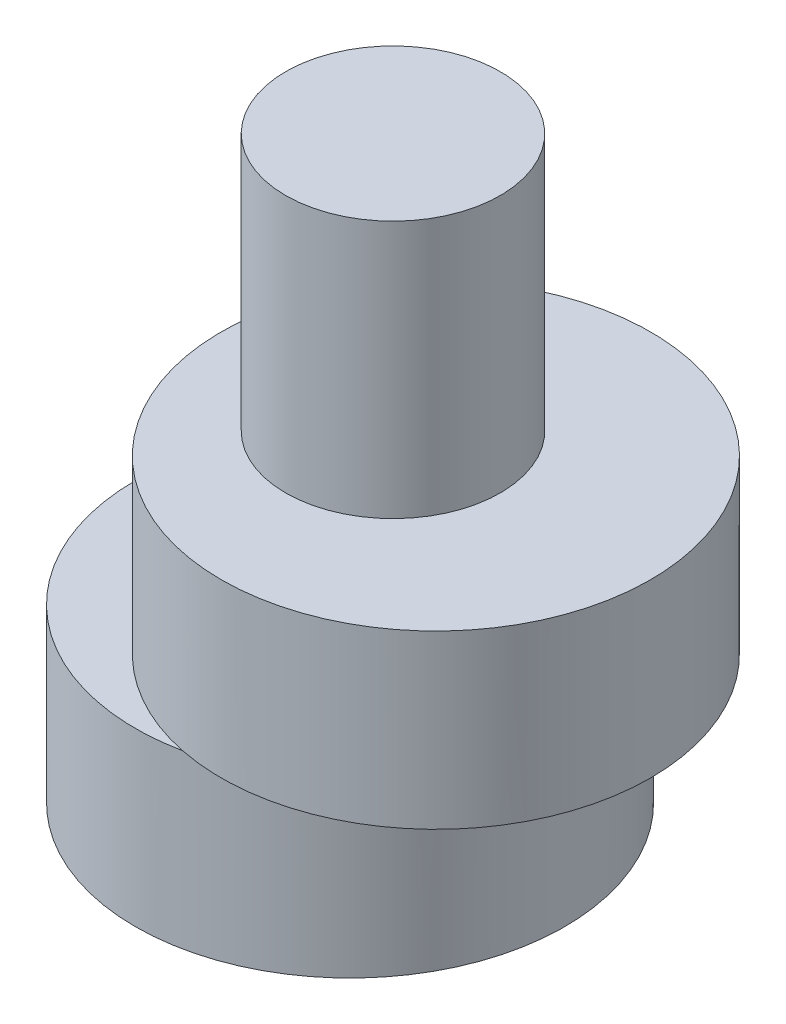
ISO-10303-21;
HEADER;
FILE_DESCRIPTION(('STEP AP214'),'2;1');
FILE_NAME('part.step','',(''),(''),'','','');
FILE_SCHEMA(('AUTOMOTIVE_DESIGN { 1 0 10303 214 1 1 1 1 }'));
ENDSEC;
DATA;
#1=APPLICATION_CONTEXT('core data for automotive mechanical design processes');
#2=APPLICATION_PROTOCOL_DEFINITION('international standard','automotive_design',2000,#1);
#3=PRODUCT_CONTEXT('',#1,'mechanical');
#4=PRODUCT('Part','Part','',(#3));
#5=PRODUCT_RELATED_PRODUCT_CATEGORY('part','',(#4));
#6=PRODUCT_DEFINITION_FORMATION('','',#4);
#7=PRODUCT_DEFINITION_CONTEXT('part definition',#1,'design');
#8=PRODUCT_DEFINITION('design','',#6,#7);
#9=PRODUCT_DEFINITION_SHAPE('','',#8);
#10=(LENGTH_UNIT() NAMED_UNIT(*) SI_UNIT(.MILLI.,.METRE.));
#11=(NAMED_UNIT(*) PLANE_ANGLE_UNIT() SI_UNIT($,.RADIAN.));
#12=(NAMED_UNIT(*) SI_UNIT($,.STERADIAN.) SOLID_ANGLE_UNIT());
#13=UNCERTAINTY_MEASURE_WITH_UNIT(LENGTH_MEASURE(1.E-05),#10,'distance_accuracy_value','');
#14=(GEOMETRIC_REPRESENTATION_CONTEXT(3) GLOBAL_UNCERTAINTY_ASSIGNED_CONTEXT((#13)) GLOBAL_UNIT_ASSIGNED_CONTEXT((#10,
#11,#12)) REPRESENTATION_CONTEXT('',''));
#15=CARTESIAN_POINT('',(0.,0.,0.));
#16=DIRECTION('',(0.,0.,1.));
#17=DIRECTION('',(1.,0.,0.));
#18=AXIS2_PLACEMENT_3D('',#15,#16,#17);
#19=CARTESIAN_POINT('',(0.,4.,0.));
#20=DIRECTION('',(0.,-1.,0.));
#21=DIRECTION('',(0.,0.,-1.));
#22=AXIS2_PLACEMENT_3D('',#19,#20,#21);
#23=CYLINDRICAL_SURFACE('',#22,3.);
#24=CARTESIAN_POINT('',(0.,6.,0.));
#25=DIRECTION('',(0.,-1.,0.));
#26=DIRECTION('',(0.,0.,-1.));
#27=AXIS2_PLACEMENT_3D('',#24,#25,#26);
#28=CIRCLE('',#27,3.);
#29=CARTESIAN_POINT('',(1.9,6.,2.32163735324878));
#30=VERTEX_POINT('',#29);
#31=CARTESIAN_POINT('',(1.9,6.,-2.32163735324878));
#32=VERTEX_POINT('',#31);
#33=EDGE_CURVE('E86',#30,#32,#28,.T.);
#34=ORIENTED_EDGE('',*,*,#33,.F.);
#35=DIRECTION('',(0.,1.,0.));
#36=VECTOR('',#35,1.);
#37=CARTESIAN_POINT('',(1.9,0.,2.32163735324878));
#38=LINE('',#37,#36);
#39=CARTESIAN_POINT('',(1.9,0.,2.32163735324878));
#40=VERTEX_POINT('',#39);
#41=EDGE_CURVE('E54',#40,#30,#38,.T.);
#42=ORIENTED_EDGE('',*,*,#41,.F.);
#43=CARTESIAN_POINT('',(0.,0.,0.));
#44=DIRECTION('',(0.,1.,0.));
#45=DIRECTION('',(0.,0.,1.));
#46=AXIS2_PLACEMENT_3D('',#43,#44,#45);
#47=CIRCLE('',#46,3.);
#48=CARTESIAN_POINT('',(1.9,0.,-2.32163735324878));
#49=VERTEX_POINT('',#48);
#50=EDGE_CURVE('E84',#49,#40,#47,.T.);
#51=ORIENTED_EDGE('',*,*,#50,.F.);
#52=DIRECTION('',(0.,1.,0.));
#53=VECTOR('',#52,1.);
#54=CARTESIAN_POINT('',(1.9,0.,-2.32163735324878));
#55=LINE('',#54,#53);
#56=EDGE_CURVE('E76',#49,#32,#55,.T.);
#57=ORIENTED_EDGE('',*,*,#56,.T.);
#58=EDGE_LOOP('',(#34,#42,#51,#57));
#59=FACE_BOUND('',#58,.T.);
#60=ADVANCED_FACE('F37',(#59),#23,.F.);
#61=CARTESIAN_POINT('',(0.,6.,0.));
#62=DIRECTION('',(0.,-1.,0.));
#63=DIRECTION('',(0.,0.,-1.));
#64=AXIS2_PLACEMENT_3D('',#61,#62,#63);
#65=PLANE('',#64);
#66=ORIENTED_EDGE('',*,*,#33,.T.);
#67=DIRECTION('',(0.,0.,-1.));
#68=VECTOR('',#67,1.);
#69=CARTESIAN_POINT('',(1.9,6.,0.));
#70=LINE('',#69,#68);
#71=EDGE_CURVE('E80',#30,#32,#70,.T.);
#72=ORIENTED_EDGE('',*,*,#71,.F.);
#73=EDGE_LOOP('',(#66,#72));
#74=FACE_BOUND('',#73,.T.);
#75=ADVANCED_FACE('F122',(#74),#65,.T.);
#76=CARTESIAN_POINT('',(-1.,4.,0.));
#77=DIRECTION('',(0.,1.,0.));
#78=DIRECTION('',(0.,0.,1.));
#79=AXIS2_PLACEMENT_3D('',#76,#77,#78);
#80=PLANE('',#79);
#81=CARTESIAN_POINT('',(1.,4.,0.));
#82=DIRECTION('',(0.,1.,0.));
#83=DIRECTION('',(0.,0.,1.));
#84=AXIS2_PLACEMENT_3D('',#81,#82,#83);
#85=CIRCLE('',#84,5.);
#86=CARTESIAN_POINT('',(0.,4.,-4.89897948556636));
#87=VERTEX_POINT('',#86);
#88=CARTESIAN_POINT('',(0.,4.,4.89897948556636));
#89=VERTEX_POINT('',#88);
#90=EDGE_CURVE('E61',#87,#89,#85,.T.);
#91=ORIENTED_EDGE('',*,*,#90,.F.);
#92=CARTESIAN_POINT('',(-1.,4.,0.));
#93=DIRECTION('',(0.,1.,0.));
#94=DIRECTION('',(0.,0.,1.));
#95=AXIS2_PLACEMENT_3D('',#92,#93,#94);
#96=CIRCLE('',#95,5.);
#97=EDGE_CURVE('E92',#87,#89,#96,.T.);
#98=ORIENTED_EDGE('',*,*,#97,.T.);
#99=EDGE_LOOP('',(#91,#98));
#100=FACE_BOUND('',#99,.T.);
#101=ADVANCED_FACE('F100',(#100),#80,.T.);
#102=CARTESIAN_POINT('',(-1.,0.,0.));
#103=DIRECTION('',(0.,1.,0.));
#104=DIRECTION('',(0.,0.,1.));
#105=AXIS2_PLACEMENT_3D('',#102,#103,#104);
#106=PLANE('',#105);
#107=CARTESIAN_POINT('',(-1.,0.,0.));
#108=DIRECTION('',(0.,1.,0.));
#109=DIRECTION('',(0.,0.,1.));
#110=AXIS2_PLACEMENT_3D('',#107,#108,#109);
#111=CIRCLE('',#110,5.);
#112=CARTESIAN_POINT('',(-1.,0.,5.));
#113=VERTEX_POINT('',#112);
#114=EDGE_CURVE('E41',#113,#113,#111,.T.);
#115=ORIENTED_EDGE('',*,*,#114,.F.);
#116=EDGE_LOOP('',(#115));
#117=FACE_BOUND('',#116,.T.);
#118=ORIENTED_EDGE('',*,*,#50,.T.);
#119=DIRECTION('',(0.,0.,-1.));
#120=VECTOR('',#119,1.);
#121=CARTESIAN_POINT('',(1.9,0.,0.));
#122=LINE('',#121,#120);
#123=EDGE_CURVE('E73',#40,#49,#122,.T.);
#124=ORIENTED_EDGE('',*,*,#123,.T.);
#125=EDGE_LOOP('',(#118,#124));
#126=FACE_BOUND('',#125,.T.);
#127=ADVANCED_FACE('F88',(#117,#126),#106,.F.);
#128=CARTESIAN_POINT('',(-1.,4.,0.));
#129=DIRECTION('',(0.,-1.,0.));
#130=DIRECTION('',(0.,0.,-1.));
#131=AXIS2_PLACEMENT_3D('',#128,#129,#130);
#132=CYLINDRICAL_SURFACE('',#131,5.);
#133=EDGE_CURVE('E46',#89,#87,#96,.T.);
#134=ORIENTED_EDGE('',*,*,#133,.F.);
#135=ORIENTED_EDGE('',*,*,#97,.F.);
#136=EDGE_LOOP('',(#134,#135));
#137=FACE_BOUND('',#136,.T.);
#138=ORIENTED_EDGE('',*,*,#114,.T.);
#139=EDGE_LOOP('',(#138));
#140=FACE_BOUND('',#139,.T.);
#141=ADVANCED_FACE('F39',(#137,#140),#132,.T.);
#142=CARTESIAN_POINT('',(1.,8.,0.));
#143=DIRECTION('',(0.,1.,0.));
#144=DIRECTION('',(0.,0.,1.));
#145=AXIS2_PLACEMENT_3D('',#142,#143,#144);
#146=PLANE('',#145);
#147=CARTESIAN_POINT('',(0.,8.,0.));
#148=DIRECTION('',(0.,1.,0.));
#149=DIRECTION('',(0.,0.,1.));
#150=AXIS2_PLACEMENT_3D('',#147,#148,#149);
#151=CIRCLE('',#150,2.5);
#152=CARTESIAN_POINT('',(0.,8.,2.5));
#153=VERTEX_POINT('',#152);
#154=EDGE_CURVE('E11',#153,#153,#151,.T.);
#155=ORIENTED_EDGE('',*,*,#154,.F.);
#156=EDGE_LOOP('',(#155));
#157=FACE_BOUND('',#156,.T.);
#158=CARTESIAN_POINT('',(1.,8.,0.));
#159=DIRECTION('',(0.,1.,0.));
#160=DIRECTION('',(0.,0.,1.));
#161=AXIS2_PLACEMENT_3D('',#158,#159,#160);
#162=CIRCLE('',#161,5.);
#163=CARTESIAN_POINT('',(1.,8.,5.));
#164=VERTEX_POINT('',#163);
#165=EDGE_CURVE('E89',#164,#164,#162,.T.);
#166=ORIENTED_EDGE('',*,*,#165,.T.);
#167=EDGE_LOOP('',(#166));
#168=FACE_BOUND('',#167,.T.);
#169=ADVANCED_FACE('F108',(#157,#168),#146,.T.);
#170=CARTESIAN_POINT('',(1.,8.,0.));
#171=DIRECTION('',(0.,-1.,0.));
#172=DIRECTION('',(0.,0.,-1.));
#173=AXIS2_PLACEMENT_3D('',#170,#171,#172);
#174=CYLINDRICAL_SURFACE('',#173,5.);
#175=ORIENTED_EDGE('',*,*,#165,.F.);
#176=EDGE_LOOP('',(#175));
#177=FACE_BOUND('',#176,.T.);
#178=ORIENTED_EDGE('',*,*,#90,.T.);
#179=EDGE_CURVE('E102',#89,#87,#85,.T.);
#180=ORIENTED_EDGE('',*,*,#179,.T.);
#181=EDGE_LOOP('',(#178,#180));
#182=FACE_BOUND('',#181,.T.);
#183=ADVANCED_FACE('F106',(#177,#182),#174,.T.);
#184=CARTESIAN_POINT('',(1.,4.,0.));
#185=DIRECTION('',(0.,1.,0.));
#186=DIRECTION('',(0.,0.,1.));
#187=AXIS2_PLACEMENT_3D('',#184,#185,#186);
#188=PLANE('',#187);
#189=ORIENTED_EDGE('',*,*,#179,.F.);
#190=ORIENTED_EDGE('',*,*,#133,.T.);
#191=EDGE_LOOP('',(#189,#190));
#192=FACE_BOUND('',#191,.T.);
#193=ADVANCED_FACE('F103',(#192),#188,.F.);
#194=CARTESIAN_POINT('',(0.,14.,0.));
#195=DIRECTION('',(0.,-1.,0.));
#196=DIRECTION('',(0.,0.,-1.));
#197=AXIS2_PLACEMENT_3D('',#194,#195,#196);
#198=CYLINDRICAL_SURFACE('',#197,2.5);
#199=CARTESIAN_POINT('',(0.,14.,0.));
#200=DIRECTION('',(0.,1.,0.));
#201=DIRECTION('',(0.,0.,1.));
#202=AXIS2_PLACEMENT_3D('',#199,#200,#201);
#203=CIRCLE('',#202,2.5);
#204=CARTESIAN_POINT('',(0.,14.,2.5));
#205=VERTEX_POINT('',#204);
#206=EDGE_CURVE('E105',#205,#205,#203,.T.);
#207=ORIENTED_EDGE('',*,*,#206,.F.);
#208=EDGE_LOOP('',(#207));
#209=FACE_BOUND('',#208,.T.);
#210=ORIENTED_EDGE('',*,*,#154,.T.);
#211=EDGE_LOOP('',(#210));
#212=FACE_BOUND('',#211,.T.);
#213=ADVANCED_FACE('F115',(#209,#212),#198,.T.);
#214=CARTESIAN_POINT('',(0.,14.,0.));
#215=DIRECTION('',(0.,1.,0.));
#216=DIRECTION('',(0.,0.,1.));
#217=AXIS2_PLACEMENT_3D('',#214,#215,#216);
#218=PLANE('',#217);
#219=ORIENTED_EDGE('',*,*,#206,.T.);
#220=EDGE_LOOP('',(#219));
#221=FACE_BOUND('',#220,.T.);
#222=ADVANCED_FACE('F157',(#221),#218,.T.);
#223=CARTESIAN_POINT('',(1.9,0.,0.));
#224=DIRECTION('',(1.,0.,0.));
#225=DIRECTION('',(0.,0.,-1.));
#226=AXIS2_PLACEMENT_3D('',#223,#224,#225);
#227=PLANE('',#226);
#228=ORIENTED_EDGE('',*,*,#71,.T.);
#229=ORIENTED_EDGE('',*,*,#56,.F.);
#230=ORIENTED_EDGE('',*,*,#123,.F.);
#231=ORIENTED_EDGE('',*,*,#41,.T.);
#232=EDGE_LOOP('',(#228,#229,#230,#231));
#233=FACE_BOUND('',#232,.T.);
#234=ADVANCED_FACE('F74',(#233),#227,.F.);
#235=CLOSED_SHELL('',(#60,#75,#101,#127,#141,#169,#183,#193,#213,#222,#234));
#236=MANIFOLD_SOLID_BREP('B2',#235);
#237=ADVANCED_BREP_SHAPE_REPRESENTATION('',(#18,#236),#14);
#238=SHAPE_DEFINITION_REPRESENTATION(#9,#237);
ENDSEC;
END-ISO-10303-21;
